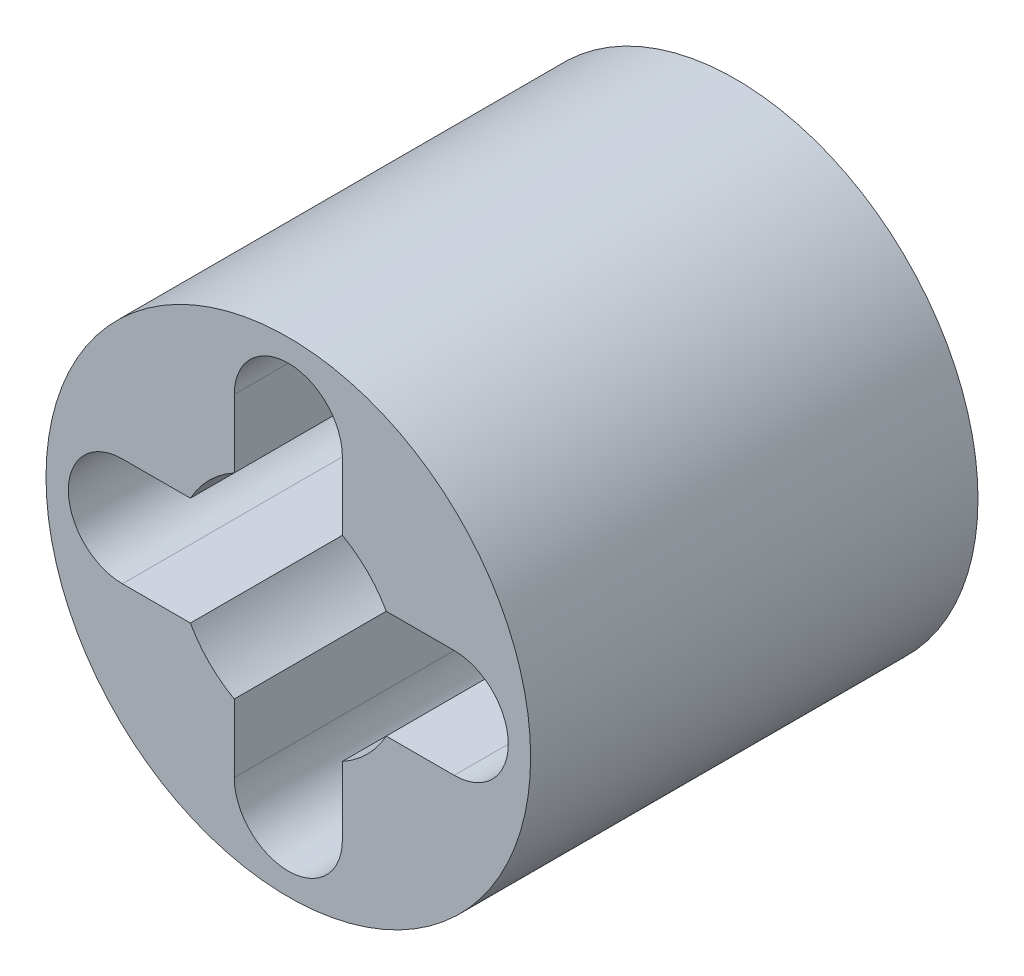
ISO-10303-21;
HEADER;
FILE_DESCRIPTION(('STEP AP214'),'2;1');
FILE_NAME('part.step','',(''),(''),'','','');
FILE_SCHEMA(('AUTOMOTIVE_DESIGN { 1 0 10303 214 1 1 1 1 }'));
ENDSEC;
DATA;
#1=APPLICATION_CONTEXT('core data for automotive mechanical design processes');
#2=APPLICATION_PROTOCOL_DEFINITION('international standard','automotive_design',2000,#1);
#3=PRODUCT_CONTEXT('',#1,'mechanical');
#4=PRODUCT('Part','Part','',(#3));
#5=PRODUCT_RELATED_PRODUCT_CATEGORY('part','',(#4));
#6=PRODUCT_DEFINITION_FORMATION('','',#4);
#7=PRODUCT_DEFINITION_CONTEXT('part definition',#1,'design');
#8=PRODUCT_DEFINITION('design','',#6,#7);
#9=PRODUCT_DEFINITION_SHAPE('','',#8);
#10=(LENGTH_UNIT() NAMED_UNIT(*) SI_UNIT(.MILLI.,.METRE.));
#11=(NAMED_UNIT(*) PLANE_ANGLE_UNIT() SI_UNIT($,.RADIAN.));
#12=(NAMED_UNIT(*) SI_UNIT($,.STERADIAN.) SOLID_ANGLE_UNIT());
#13=UNCERTAINTY_MEASURE_WITH_UNIT(LENGTH_MEASURE(1.E-05),#10,'distance_accuracy_value','');
#14=(GEOMETRIC_REPRESENTATION_CONTEXT(3) GLOBAL_UNCERTAINTY_ASSIGNED_CONTEXT((#13)) GLOBAL_UNIT_ASSIGNED_CONTEXT((#10,
#11,#12)) REPRESENTATION_CONTEXT('',''));
#15=CARTESIAN_POINT('',(0.,0.,0.));
#16=DIRECTION('',(0.,0.,1.));
#17=DIRECTION('',(1.,0.,0.));
#18=AXIS2_PLACEMENT_3D('',#15,#16,#17);
#19=CARTESIAN_POINT('',(0.,0.,6.));
#20=DIRECTION('',(0.,0.,1.));
#21=DIRECTION('',(1.,0.,0.));
#22=AXIS2_PLACEMENT_3D('',#19,#20,#21);
#23=PLANE('',#22);
#24=CARTESIAN_POINT('',(0.,0.,6.));
#25=DIRECTION('',(0.,0.,1.));
#26=DIRECTION('',(1.,0.,0.));
#27=AXIS2_PLACEMENT_3D('',#24,#25,#26);
#28=CIRCLE('',#27,3.25);
#29=CARTESIAN_POINT('',(3.25,0.,6.));
#30=VERTEX_POINT('',#29);
#31=EDGE_CURVE('E11',#30,#30,#28,.T.);
#32=ORIENTED_EDGE('',*,*,#31,.T.);
#33=EDGE_LOOP('',(#32));
#34=FACE_BOUND('',#33,.T.);
#35=DIRECTION('',(1.,0.,0.));
#36=VECTOR('',#35,1.);
#37=CARTESIAN_POINT('',(2.22500000000006,-0.724999999999986,6.));
#38=LINE('',#37,#36);
#39=CARTESIAN_POINT('',(1.31315459866689,-0.724999999999986,6.));
#40=VERTEX_POINT('',#39);
#41=CARTESIAN_POINT('',(2.22500000000006,-0.724999999999961,6.));
#42=VERTEX_POINT('',#41);
#43=EDGE_CURVE('E154',#40,#42,#38,.T.);
#44=ORIENTED_EDGE('',*,*,#43,.F.);
#45=CARTESIAN_POINT('',(0.,0.,6.));
#46=DIRECTION('',(0.,0.,1.));
#47=DIRECTION('',(1.,0.,0.));
#48=AXIS2_PLACEMENT_3D('',#45,#46,#47);
#49=CIRCLE('',#48,1.5);
#50=CARTESIAN_POINT('',(0.725000000000126,-1.31315459866682,6.));
#51=VERTEX_POINT('',#50);
#52=EDGE_CURVE('E146',#51,#40,#49,.T.);
#53=ORIENTED_EDGE('',*,*,#52,.F.);
#54=DIRECTION('',(0.,1.,0.));
#55=VECTOR('',#54,1.);
#56=CARTESIAN_POINT('',(0.725000000000126,-2.225,6.));
#57=LINE('',#56,#55);
#58=CARTESIAN_POINT('',(0.725000000000126,-2.225,6.));
#59=VERTEX_POINT('',#58);
#60=EDGE_CURVE('E194',#59,#51,#57,.T.);
#61=ORIENTED_EDGE('',*,*,#60,.F.);
#62=CARTESIAN_POINT('',(1.25931639139677E-13,-2.225,6.));
#63=DIRECTION('',(0.,0.,1.));
#64=DIRECTION('',(1.,0.,0.));
#65=AXIS2_PLACEMENT_3D('',#62,#63,#64);
#66=CIRCLE('',#65,0.725);
#67=CARTESIAN_POINT('',(-0.724999999999874,-2.225,6.));
#68=VERTEX_POINT('',#67);
#69=EDGE_CURVE('E192',#68,#59,#66,.T.);
#70=ORIENTED_EDGE('',*,*,#69,.F.);
#71=DIRECTION('',(0.,-1.,0.));
#72=VECTOR('',#71,1.);
#73=CARTESIAN_POINT('',(-0.724999999999874,-2.225,6.));
#74=LINE('',#73,#72);
#75=CARTESIAN_POINT('',(-0.724999999999874,-1.31315459866696,6.));
#76=VERTEX_POINT('',#75);
#77=EDGE_CURVE('E190',#76,#68,#74,.T.);
#78=ORIENTED_EDGE('',*,*,#77,.F.);
#79=CARTESIAN_POINT('',(0.,0.,6.));
#80=DIRECTION('',(0.,0.,1.));
#81=DIRECTION('',(1.,0.,0.));
#82=AXIS2_PLACEMENT_3D('',#79,#80,#81);
#83=CIRCLE('',#82,1.5);
#84=CARTESIAN_POINT('',(-1.31315459866689,-0.725,6.));
#85=VERTEX_POINT('',#84);
#86=EDGE_CURVE('E188',#85,#76,#83,.T.);
#87=ORIENTED_EDGE('',*,*,#86,.F.);
#88=DIRECTION('',(1.,0.,0.));
#89=VECTOR('',#88,1.);
#90=CARTESIAN_POINT('',(-2.22499999999994,-0.725000000000063,6.));
#91=LINE('',#90,#89);
#92=CARTESIAN_POINT('',(-2.22499999999994,-0.725000000000063,6.));
#93=VERTEX_POINT('',#92);
#94=EDGE_CURVE('E186',#93,#85,#91,.T.);
#95=ORIENTED_EDGE('',*,*,#94,.F.);
#96=CARTESIAN_POINT('',(-2.22499999999994,0.,6.));
#97=DIRECTION('',(0.,0.,1.));
#98=DIRECTION('',(1.,0.,0.));
#99=AXIS2_PLACEMENT_3D('',#96,#97,#98);
#100=CIRCLE('',#99,0.725);
#101=CARTESIAN_POINT('',(-2.22499999999994,0.724999999999937,6.));
#102=VERTEX_POINT('',#101);
#103=EDGE_CURVE('E184',#102,#93,#100,.T.);
#104=ORIENTED_EDGE('',*,*,#103,.F.);
#105=DIRECTION('',(-1.,0.,0.));
#106=VECTOR('',#105,1.);
#107=CARTESIAN_POINT('',(-2.22499999999994,0.724999999999937,6.));
#108=LINE('',#107,#106);
#109=CARTESIAN_POINT('',(-1.31315459866692,0.724999999999937,6.));
#110=VERTEX_POINT('',#109);
#111=EDGE_CURVE('E182',#110,#102,#108,.T.);
#112=ORIENTED_EDGE('',*,*,#111,.F.);
#113=CARTESIAN_POINT('',(0.,0.,6.));
#114=DIRECTION('',(0.,0.,1.));
#115=DIRECTION('',(1.,0.,0.));
#116=AXIS2_PLACEMENT_3D('',#113,#114,#115);
#117=CIRCLE('',#116,1.49999999999999);
#118=CARTESIAN_POINT('',(-0.725000000000003,1.31315459866688,6.));
#119=VERTEX_POINT('',#118);
#120=EDGE_CURVE('E180',#119,#110,#117,.T.);
#121=ORIENTED_EDGE('',*,*,#120,.F.);
#122=DIRECTION('',(0.,-1.,0.));
#123=VECTOR('',#122,1.);
#124=CARTESIAN_POINT('',(-0.725,2.225,6.));
#125=LINE('',#124,#123);
#126=CARTESIAN_POINT('',(-0.725,2.225,6.));
#127=VERTEX_POINT('',#126);
#128=EDGE_CURVE('E178',#127,#119,#125,.T.);
#129=ORIENTED_EDGE('',*,*,#128,.F.);
#130=CARTESIAN_POINT('',(0.,2.225,6.));
#131=DIRECTION('',(0.,0.,1.));
#132=DIRECTION('',(1.,0.,0.));
#133=AXIS2_PLACEMENT_3D('',#130,#131,#132);
#134=CIRCLE('',#133,0.725);
#135=CARTESIAN_POINT('',(0.725,2.225,6.));
#136=VERTEX_POINT('',#135);
#137=EDGE_CURVE('E176',#136,#127,#134,.T.);
#138=ORIENTED_EDGE('',*,*,#137,.F.);
#139=DIRECTION('',(0.,1.,0.));
#140=VECTOR('',#139,1.);
#141=CARTESIAN_POINT('',(0.725,2.225,6.));
#142=LINE('',#141,#140);
#143=CARTESIAN_POINT('',(0.725,1.31315459866689,6.));
#144=VERTEX_POINT('',#143);
#145=EDGE_CURVE('E174',#144,#136,#142,.T.);
#146=ORIENTED_EDGE('',*,*,#145,.F.);
#147=CARTESIAN_POINT('',(0.,0.,6.));
#148=DIRECTION('',(0.,0.,1.));
#149=DIRECTION('',(1.,0.,0.));
#150=AXIS2_PLACEMENT_3D('',#147,#148,#149);
#151=CIRCLE('',#150,1.5);
#152=CARTESIAN_POINT('',(1.31315459866688,0.725000000000001,6.));
#153=VERTEX_POINT('',#152);
#154=EDGE_CURVE('E172',#153,#144,#151,.T.);
#155=ORIENTED_EDGE('',*,*,#154,.F.);
#156=DIRECTION('',(-1.,0.,0.));
#157=VECTOR('',#156,1.);
#158=CARTESIAN_POINT('',(2.22500000000006,0.725000000000063,6.));
#159=LINE('',#158,#157);
#160=CARTESIAN_POINT('',(2.22500000000006,0.725000000000063,6.));
#161=VERTEX_POINT('',#160);
#162=EDGE_CURVE('E168',#161,#153,#159,.T.);
#163=ORIENTED_EDGE('',*,*,#162,.F.);
#164=CARTESIAN_POINT('',(2.22500000000006,0.,6.));
#165=DIRECTION('',(0.,0.,1.));
#166=DIRECTION('',(1.,0.,0.));
#167=AXIS2_PLACEMENT_3D('',#164,#165,#166);
#168=CIRCLE('',#167,0.725000000000025);
#169=EDGE_CURVE('E166',#42,#161,#168,.T.);
#170=ORIENTED_EDGE('',*,*,#169,.F.);
#171=EDGE_LOOP('',(#44,#53,#61,#70,#78,#87,#95,#104,#112,#121,#129,#138,#146,#155,#163,#170));
#172=FACE_BOUND('',#171,.T.);
#173=ADVANCED_FACE('F33',(#34,#172),#23,.T.);
#174=CARTESIAN_POINT('',(0.,0.,0.));
#175=DIRECTION('',(0.,0.,1.));
#176=DIRECTION('',(1.,0.,0.));
#177=AXIS2_PLACEMENT_3D('',#174,#175,#176);
#178=PLANE('',#177);
#179=CARTESIAN_POINT('',(0.,0.,0.));
#180=DIRECTION('',(0.,0.,1.));
#181=DIRECTION('',(1.,0.,0.));
#182=AXIS2_PLACEMENT_3D('',#179,#180,#181);
#183=CIRCLE('',#182,3.25);
#184=CARTESIAN_POINT('',(3.25,0.,0.));
#185=VERTEX_POINT('',#184);
#186=EDGE_CURVE('E37',#185,#185,#183,.T.);
#187=ORIENTED_EDGE('',*,*,#186,.F.);
#188=EDGE_LOOP('',(#187));
#189=FACE_BOUND('',#188,.T.);
#190=CARTESIAN_POINT('',(0.,0.,0.));
#191=DIRECTION('',(0.,0.,1.));
#192=DIRECTION('',(1.,0.,0.));
#193=AXIS2_PLACEMENT_3D('',#190,#191,#192);
#194=CIRCLE('',#193,1.5);
#195=CARTESIAN_POINT('',(0.725000000000126,-1.31315459866682,0.));
#196=VERTEX_POINT('',#195);
#197=CARTESIAN_POINT('',(1.31315459866689,-0.724999999999986,0.));
#198=VERTEX_POINT('',#197);
#199=EDGE_CURVE('E56',#196,#198,#194,.T.);
#200=ORIENTED_EDGE('',*,*,#199,.T.);
#201=DIRECTION('',(1.,0.,0.));
#202=VECTOR('',#201,1.);
#203=CARTESIAN_POINT('',(2.22500000000006,-0.724999999999986,0.));
#204=LINE('',#203,#202);
#205=CARTESIAN_POINT('',(2.22500000000006,-0.724999999999961,0.));
#206=VERTEX_POINT('',#205);
#207=EDGE_CURVE('E161',#198,#206,#204,.T.);
#208=ORIENTED_EDGE('',*,*,#207,.T.);
#209=CARTESIAN_POINT('',(2.22500000000006,0.,0.));
#210=DIRECTION('',(0.,0.,1.));
#211=DIRECTION('',(1.,0.,0.));
#212=AXIS2_PLACEMENT_3D('',#209,#210,#211);
#213=CIRCLE('',#212,0.725000000000025);
#214=CARTESIAN_POINT('',(2.22500000000006,0.725000000000063,0.));
#215=VERTEX_POINT('',#214);
#216=EDGE_CURVE('E198',#206,#215,#213,.T.);
#217=ORIENTED_EDGE('',*,*,#216,.T.);
#218=DIRECTION('',(-1.,0.,0.));
#219=VECTOR('',#218,1.);
#220=CARTESIAN_POINT('',(2.22500000000006,0.725000000000063,0.));
#221=LINE('',#220,#219);
#222=CARTESIAN_POINT('',(1.31315459866688,0.725000000000001,0.));
#223=VERTEX_POINT('',#222);
#224=EDGE_CURVE('E201',#215,#223,#221,.T.);
#225=ORIENTED_EDGE('',*,*,#224,.T.);
#226=CARTESIAN_POINT('',(0.,0.,0.));
#227=DIRECTION('',(0.,0.,1.));
#228=DIRECTION('',(1.,0.,0.));
#229=AXIS2_PLACEMENT_3D('',#226,#227,#228);
#230=CIRCLE('',#229,1.5);
#231=CARTESIAN_POINT('',(0.725,1.31315459866689,0.));
#232=VERTEX_POINT('',#231);
#233=EDGE_CURVE('E204',#223,#232,#230,.T.);
#234=ORIENTED_EDGE('',*,*,#233,.T.);
#235=DIRECTION('',(0.,1.,0.));
#236=VECTOR('',#235,1.);
#237=CARTESIAN_POINT('',(0.725,2.225,0.));
#238=LINE('',#237,#236);
#239=CARTESIAN_POINT('',(0.725,2.225,0.));
#240=VERTEX_POINT('',#239);
#241=EDGE_CURVE('E207',#232,#240,#238,.T.);
#242=ORIENTED_EDGE('',*,*,#241,.T.);
#243=CARTESIAN_POINT('',(0.,2.225,0.));
#244=DIRECTION('',(0.,0.,1.));
#245=DIRECTION('',(1.,0.,0.));
#246=AXIS2_PLACEMENT_3D('',#243,#244,#245);
#247=CIRCLE('',#246,0.725);
#248=CARTESIAN_POINT('',(-0.725,2.225,0.));
#249=VERTEX_POINT('',#248);
#250=EDGE_CURVE('E210',#240,#249,#247,.T.);
#251=ORIENTED_EDGE('',*,*,#250,.T.);
#252=DIRECTION('',(0.,-1.,0.));
#253=VECTOR('',#252,1.);
#254=CARTESIAN_POINT('',(-0.725,2.225,0.));
#255=LINE('',#254,#253);
#256=CARTESIAN_POINT('',(-0.725000000000003,1.31315459866688,0.));
#257=VERTEX_POINT('',#256);
#258=EDGE_CURVE('E213',#249,#257,#255,.T.);
#259=ORIENTED_EDGE('',*,*,#258,.T.);
#260=CARTESIAN_POINT('',(0.,0.,0.));
#261=DIRECTION('',(0.,0.,1.));
#262=DIRECTION('',(1.,0.,0.));
#263=AXIS2_PLACEMENT_3D('',#260,#261,#262);
#264=CIRCLE('',#263,1.49999999999999);
#265=CARTESIAN_POINT('',(-1.31315459866692,0.724999999999937,0.));
#266=VERTEX_POINT('',#265);
#267=EDGE_CURVE('E216',#257,#266,#264,.T.);
#268=ORIENTED_EDGE('',*,*,#267,.T.);
#269=DIRECTION('',(-1.,0.,0.));
#270=VECTOR('',#269,1.);
#271=CARTESIAN_POINT('',(-2.22499999999994,0.724999999999937,0.));
#272=LINE('',#271,#270);
#273=CARTESIAN_POINT('',(-2.22499999999994,0.724999999999937,0.));
#274=VERTEX_POINT('',#273);
#275=EDGE_CURVE('E219',#266,#274,#272,.T.);
#276=ORIENTED_EDGE('',*,*,#275,.T.);
#277=CARTESIAN_POINT('',(-2.22499999999994,0.,0.));
#278=DIRECTION('',(0.,0.,1.));
#279=DIRECTION('',(1.,0.,0.));
#280=AXIS2_PLACEMENT_3D('',#277,#278,#279);
#281=CIRCLE('',#280,0.725);
#282=CARTESIAN_POINT('',(-2.22499999999994,-0.725000000000063,0.));
#283=VERTEX_POINT('',#282);
#284=EDGE_CURVE('E222',#274,#283,#281,.T.);
#285=ORIENTED_EDGE('',*,*,#284,.T.);
#286=DIRECTION('',(1.,0.,0.));
#287=VECTOR('',#286,1.);
#288=CARTESIAN_POINT('',(-2.22499999999994,-0.725000000000063,0.));
#289=LINE('',#288,#287);
#290=CARTESIAN_POINT('',(-1.31315459866689,-0.725,0.));
#291=VERTEX_POINT('',#290);
#292=EDGE_CURVE('E225',#283,#291,#289,.T.);
#293=ORIENTED_EDGE('',*,*,#292,.T.);
#294=CARTESIAN_POINT('',(0.,0.,0.));
#295=DIRECTION('',(0.,0.,1.));
#296=DIRECTION('',(1.,0.,0.));
#297=AXIS2_PLACEMENT_3D('',#294,#295,#296);
#298=CIRCLE('',#297,1.5);
#299=CARTESIAN_POINT('',(-0.724999999999874,-1.31315459866696,0.));
#300=VERTEX_POINT('',#299);
#301=EDGE_CURVE('E228',#291,#300,#298,.T.);
#302=ORIENTED_EDGE('',*,*,#301,.T.);
#303=DIRECTION('',(0.,-1.,0.));
#304=VECTOR('',#303,1.);
#305=CARTESIAN_POINT('',(-0.724999999999874,-2.225,0.));
#306=LINE('',#305,#304);
#307=CARTESIAN_POINT('',(-0.724999999999874,-2.225,0.));
#308=VERTEX_POINT('',#307);
#309=EDGE_CURVE('E231',#300,#308,#306,.T.);
#310=ORIENTED_EDGE('',*,*,#309,.T.);
#311=CARTESIAN_POINT('',(1.25931639139677E-13,-2.225,0.));
#312=DIRECTION('',(0.,0.,1.));
#313=DIRECTION('',(1.,0.,0.));
#314=AXIS2_PLACEMENT_3D('',#311,#312,#313);
#315=CIRCLE('',#314,0.725);
#316=CARTESIAN_POINT('',(0.725000000000126,-2.225,0.));
#317=VERTEX_POINT('',#316);
#318=EDGE_CURVE('E234',#308,#317,#315,.T.);
#319=ORIENTED_EDGE('',*,*,#318,.T.);
#320=DIRECTION('',(0.,1.,0.));
#321=VECTOR('',#320,1.);
#322=CARTESIAN_POINT('',(0.725000000000126,-2.225,0.));
#323=LINE('',#322,#321);
#324=EDGE_CURVE('E155',#317,#196,#323,.T.);
#325=ORIENTED_EDGE('',*,*,#324,.T.);
#326=EDGE_LOOP('',(#200,#208,#217,#225,#234,#242,#251,#259,#268,#276,#285,#293,#302,#310,#319,#325));
#327=FACE_BOUND('',#326,.T.);
#328=ADVANCED_FACE('F271',(#189,#327),#178,.F.);
#329=CARTESIAN_POINT('',(0.,0.,6.));
#330=DIRECTION('',(0.,0.,-1.));
#331=DIRECTION('',(-1.,0.,0.));
#332=AXIS2_PLACEMENT_3D('',#329,#330,#331);
#333=CYLINDRICAL_SURFACE('',#332,3.25);
#334=ORIENTED_EDGE('',*,*,#31,.F.);
#335=EDGE_LOOP('',(#334));
#336=FACE_BOUND('',#335,.T.);
#337=ORIENTED_EDGE('',*,*,#186,.T.);
#338=EDGE_LOOP('',(#337));
#339=FACE_BOUND('',#338,.T.);
#340=ADVANCED_FACE('F35',(#336,#339),#333,.T.);
#341=CARTESIAN_POINT('',(0.,0.,6.));
#342=DIRECTION('',(0.,0.,-1.));
#343=DIRECTION('',(-1.,0.,0.));
#344=AXIS2_PLACEMENT_3D('',#341,#342,#343);
#345=CYLINDRICAL_SURFACE('',#344,1.5);
#346=ORIENTED_EDGE('',*,*,#199,.F.);
#347=DIRECTION('',(0.,0.,-1.));
#348=VECTOR('',#347,1.);
#349=CARTESIAN_POINT('',(0.725000000000126,-1.31315459866682,6.));
#350=LINE('',#349,#348);
#351=EDGE_CURVE('E150',#51,#196,#350,.T.);
#352=ORIENTED_EDGE('',*,*,#351,.F.);
#353=ORIENTED_EDGE('',*,*,#52,.T.);
#354=DIRECTION('',(0.,0.,-1.));
#355=VECTOR('',#354,1.);
#356=CARTESIAN_POINT('',(1.31315459866689,-0.724999999999986,6.));
#357=LINE('',#356,#355);
#358=EDGE_CURVE('E149',#40,#198,#357,.T.);
#359=ORIENTED_EDGE('',*,*,#358,.T.);
#360=EDGE_LOOP('',(#346,#352,#353,#359));
#361=FACE_BOUND('',#360,.T.);
#362=ADVANCED_FACE('F148',(#361),#345,.F.);
#363=CARTESIAN_POINT('',(2.22500000000006,-0.724999999999986,6.));
#364=DIRECTION('',(0.,1.,0.));
#365=DIRECTION('',(0.,0.,1.));
#366=AXIS2_PLACEMENT_3D('',#363,#364,#365);
#367=PLANE('',#366);
#368=ORIENTED_EDGE('',*,*,#207,.F.);
#369=ORIENTED_EDGE('',*,*,#358,.F.);
#370=ORIENTED_EDGE('',*,*,#43,.T.);
#371=DIRECTION('',(0.,0.,-1.));
#372=VECTOR('',#371,1.);
#373=CARTESIAN_POINT('',(2.22500000000006,-0.724999999999961,6.));
#374=LINE('',#373,#372);
#375=EDGE_CURVE('E162',#42,#206,#374,.T.);
#376=ORIENTED_EDGE('',*,*,#375,.T.);
#377=EDGE_LOOP('',(#368,#369,#370,#376));
#378=FACE_BOUND('',#377,.T.);
#379=ADVANCED_FACE('F158',(#378),#367,.T.);
#380=CARTESIAN_POINT('',(2.22500000000006,0.,6.));
#381=DIRECTION('',(0.,0.,-1.));
#382=DIRECTION('',(-1.,0.,0.));
#383=AXIS2_PLACEMENT_3D('',#380,#381,#382);
#384=CYLINDRICAL_SURFACE('',#383,0.725000000000025);
#385=ORIENTED_EDGE('',*,*,#216,.F.);
#386=ORIENTED_EDGE('',*,*,#375,.F.);
#387=ORIENTED_EDGE('',*,*,#169,.T.);
#388=DIRECTION('',(0.,0.,-1.));
#389=VECTOR('',#388,1.);
#390=CARTESIAN_POINT('',(2.22500000000006,0.725000000000063,6.));
#391=LINE('',#390,#389);
#392=EDGE_CURVE('E263',#161,#215,#391,.T.);
#393=ORIENTED_EDGE('',*,*,#392,.T.);
#394=EDGE_LOOP('',(#385,#386,#387,#393));
#395=FACE_BOUND('',#394,.T.);
#396=ADVANCED_FACE('F267',(#395),#384,.F.);
#397=CARTESIAN_POINT('',(2.22500000000006,0.725000000000063,6.));
#398=DIRECTION('',(0.,-1.,0.));
#399=DIRECTION('',(1.,0.,0.));
#400=AXIS2_PLACEMENT_3D('',#397,#398,#399);
#401=PLANE('',#400);
#402=ORIENTED_EDGE('',*,*,#224,.F.);
#403=ORIENTED_EDGE('',*,*,#392,.F.);
#404=ORIENTED_EDGE('',*,*,#162,.T.);
#405=DIRECTION('',(0.,0.,-1.));
#406=VECTOR('',#405,1.);
#407=CARTESIAN_POINT('',(1.31315459866688,0.725000000000001,6.));
#408=LINE('',#407,#406);
#409=EDGE_CURVE('E261',#153,#223,#408,.T.);
#410=ORIENTED_EDGE('',*,*,#409,.T.);
#411=EDGE_LOOP('',(#402,#403,#404,#410));
#412=FACE_BOUND('',#411,.T.);
#413=ADVANCED_FACE('F329',(#412),#401,.T.);
#414=CARTESIAN_POINT('',(0.,0.,6.));
#415=DIRECTION('',(0.,0.,-1.));
#416=DIRECTION('',(-1.,0.,0.));
#417=AXIS2_PLACEMENT_3D('',#414,#415,#416);
#418=CYLINDRICAL_SURFACE('',#417,1.5);
#419=ORIENTED_EDGE('',*,*,#233,.F.);
#420=ORIENTED_EDGE('',*,*,#409,.F.);
#421=ORIENTED_EDGE('',*,*,#154,.T.);
#422=DIRECTION('',(0.,0.,-1.));
#423=VECTOR('',#422,1.);
#424=CARTESIAN_POINT('',(0.725,1.31315459866689,6.));
#425=LINE('',#424,#423);
#426=EDGE_CURVE('E259',#144,#232,#425,.T.);
#427=ORIENTED_EDGE('',*,*,#426,.T.);
#428=EDGE_LOOP('',(#419,#420,#421,#427));
#429=FACE_BOUND('',#428,.T.);
#430=ADVANCED_FACE('F326',(#429),#418,.F.);
#431=CARTESIAN_POINT('',(0.725,2.225,6.));
#432=DIRECTION('',(-1.,0.,0.));
#433=DIRECTION('',(0.,0.,1.));
#434=AXIS2_PLACEMENT_3D('',#431,#432,#433);
#435=PLANE('',#434);
#436=ORIENTED_EDGE('',*,*,#241,.F.);
#437=ORIENTED_EDGE('',*,*,#426,.F.);
#438=ORIENTED_EDGE('',*,*,#145,.T.);
#439=DIRECTION('',(0.,0.,-1.));
#440=VECTOR('',#439,1.);
#441=CARTESIAN_POINT('',(0.725,2.225,6.));
#442=LINE('',#441,#440);
#443=EDGE_CURVE('E257',#136,#240,#442,.T.);
#444=ORIENTED_EDGE('',*,*,#443,.T.);
#445=EDGE_LOOP('',(#436,#437,#438,#444));
#446=FACE_BOUND('',#445,.T.);
#447=ADVANCED_FACE('F323',(#446),#435,.T.);
#448=CARTESIAN_POINT('',(0.,2.225,6.));
#449=DIRECTION('',(0.,0.,-1.));
#450=DIRECTION('',(-1.,0.,0.));
#451=AXIS2_PLACEMENT_3D('',#448,#449,#450);
#452=CYLINDRICAL_SURFACE('',#451,0.725);
#453=ORIENTED_EDGE('',*,*,#250,.F.);
#454=ORIENTED_EDGE('',*,*,#443,.F.);
#455=ORIENTED_EDGE('',*,*,#137,.T.);
#456=DIRECTION('',(0.,0.,-1.));
#457=VECTOR('',#456,1.);
#458=CARTESIAN_POINT('',(-0.725,2.225,6.));
#459=LINE('',#458,#457);
#460=EDGE_CURVE('E255',#127,#249,#459,.T.);
#461=ORIENTED_EDGE('',*,*,#460,.T.);
#462=EDGE_LOOP('',(#453,#454,#455,#461));
#463=FACE_BOUND('',#462,.T.);
#464=ADVANCED_FACE('F316',(#463),#452,.F.);
#465=CARTESIAN_POINT('',(-0.725,2.225,6.));
#466=DIRECTION('',(1.,0.,0.));
#467=DIRECTION('',(0.,0.,-1.));
#468=AXIS2_PLACEMENT_3D('',#465,#466,#467);
#469=PLANE('',#468);
#470=ORIENTED_EDGE('',*,*,#258,.F.);
#471=ORIENTED_EDGE('',*,*,#460,.F.);
#472=ORIENTED_EDGE('',*,*,#128,.T.);
#473=DIRECTION('',(0.,0.,-1.));
#474=VECTOR('',#473,1.);
#475=CARTESIAN_POINT('',(-0.725000000000003,1.31315459866688,6.));
#476=LINE('',#475,#474);
#477=EDGE_CURVE('E253',#119,#257,#476,.T.);
#478=ORIENTED_EDGE('',*,*,#477,.T.);
#479=EDGE_LOOP('',(#470,#471,#472,#478));
#480=FACE_BOUND('',#479,.T.);
#481=ADVANCED_FACE('F312',(#480),#469,.T.);
#482=CARTESIAN_POINT('',(0.,0.,6.));
#483=DIRECTION('',(0.,0.,-1.));
#484=DIRECTION('',(-1.,0.,0.));
#485=AXIS2_PLACEMENT_3D('',#482,#483,#484);
#486=CYLINDRICAL_SURFACE('',#485,1.49999999999999);
#487=ORIENTED_EDGE('',*,*,#267,.F.);
#488=ORIENTED_EDGE('',*,*,#477,.F.);
#489=ORIENTED_EDGE('',*,*,#120,.T.);
#490=DIRECTION('',(0.,0.,-1.));
#491=VECTOR('',#490,1.);
#492=CARTESIAN_POINT('',(-1.31315459866692,0.724999999999937,6.));
#493=LINE('',#492,#491);
#494=EDGE_CURVE('E251',#110,#266,#493,.T.);
#495=ORIENTED_EDGE('',*,*,#494,.T.);
#496=EDGE_LOOP('',(#487,#488,#489,#495));
#497=FACE_BOUND('',#496,.T.);
#498=ADVANCED_FACE('F309',(#497),#486,.F.);
#499=CARTESIAN_POINT('',(-2.22499999999994,0.724999999999937,6.));
#500=DIRECTION('',(0.,-1.,0.));
#501=DIRECTION('',(0.,0.,-1.));
#502=AXIS2_PLACEMENT_3D('',#499,#500,#501);
#503=PLANE('',#502);
#504=ORIENTED_EDGE('',*,*,#275,.F.);
#505=ORIENTED_EDGE('',*,*,#494,.F.);
#506=ORIENTED_EDGE('',*,*,#111,.T.);
#507=DIRECTION('',(0.,0.,-1.));
#508=VECTOR('',#507,1.);
#509=CARTESIAN_POINT('',(-2.22499999999994,0.724999999999937,6.));
#510=LINE('',#509,#508);
#511=EDGE_CURVE('E249',#102,#274,#510,.T.);
#512=ORIENTED_EDGE('',*,*,#511,.T.);
#513=EDGE_LOOP('',(#504,#505,#506,#512));
#514=FACE_BOUND('',#513,.T.);
#515=ADVANCED_FACE('F301',(#514),#503,.T.);
#516=CARTESIAN_POINT('',(-2.22499999999994,0.,6.));
#517=DIRECTION('',(0.,0.,-1.));
#518=DIRECTION('',(-1.,0.,0.));
#519=AXIS2_PLACEMENT_3D('',#516,#517,#518);
#520=CYLINDRICAL_SURFACE('',#519,0.725);
#521=ORIENTED_EDGE('',*,*,#284,.F.);
#522=ORIENTED_EDGE('',*,*,#511,.F.);
#523=ORIENTED_EDGE('',*,*,#103,.T.);
#524=DIRECTION('',(0.,0.,-1.));
#525=VECTOR('',#524,1.);
#526=CARTESIAN_POINT('',(-2.22499999999994,-0.725000000000063,6.));
#527=LINE('',#526,#525);
#528=EDGE_CURVE('E247',#93,#283,#527,.T.);
#529=ORIENTED_EDGE('',*,*,#528,.T.);
#530=EDGE_LOOP('',(#521,#522,#523,#529));
#531=FACE_BOUND('',#530,.T.);
#532=ADVANCED_FACE('F297',(#531),#520,.F.);
#533=CARTESIAN_POINT('',(-2.22499999999994,-0.725000000000063,6.));
#534=DIRECTION('',(0.,1.,0.));
#535=DIRECTION('',(-1.,0.,0.));
#536=AXIS2_PLACEMENT_3D('',#533,#534,#535);
#537=PLANE('',#536);
#538=ORIENTED_EDGE('',*,*,#292,.F.);
#539=ORIENTED_EDGE('',*,*,#528,.F.);
#540=ORIENTED_EDGE('',*,*,#94,.T.);
#541=DIRECTION('',(0.,0.,-1.));
#542=VECTOR('',#541,1.);
#543=CARTESIAN_POINT('',(-1.31315459866689,-0.725,6.));
#544=LINE('',#543,#542);
#545=EDGE_CURVE('E245',#85,#291,#544,.T.);
#546=ORIENTED_EDGE('',*,*,#545,.T.);
#547=EDGE_LOOP('',(#538,#539,#540,#546));
#548=FACE_BOUND('',#547,.T.);
#549=ADVANCED_FACE('F294',(#548),#537,.T.);
#550=CARTESIAN_POINT('',(0.,0.,6.));
#551=DIRECTION('',(0.,0.,-1.));
#552=DIRECTION('',(-1.,0.,0.));
#553=AXIS2_PLACEMENT_3D('',#550,#551,#552);
#554=CYLINDRICAL_SURFACE('',#553,1.5);
#555=ORIENTED_EDGE('',*,*,#301,.F.);
#556=ORIENTED_EDGE('',*,*,#545,.F.);
#557=ORIENTED_EDGE('',*,*,#86,.T.);
#558=DIRECTION('',(0.,0.,-1.));
#559=VECTOR('',#558,1.);
#560=CARTESIAN_POINT('',(-0.724999999999874,-1.31315459866696,6.));
#561=LINE('',#560,#559);
#562=EDGE_CURVE('E243',#76,#300,#561,.T.);
#563=ORIENTED_EDGE('',*,*,#562,.T.);
#564=EDGE_LOOP('',(#555,#556,#557,#563));
#565=FACE_BOUND('',#564,.T.);
#566=ADVANCED_FACE('F286',(#565),#554,.F.);
#567=CARTESIAN_POINT('',(-0.724999999999874,-2.225,6.));
#568=DIRECTION('',(1.,0.,0.));
#569=DIRECTION('',(0.,1.,0.));
#570=AXIS2_PLACEMENT_3D('',#567,#568,#569);
#571=PLANE('',#570);
#572=ORIENTED_EDGE('',*,*,#309,.F.);
#573=ORIENTED_EDGE('',*,*,#562,.F.);
#574=ORIENTED_EDGE('',*,*,#77,.T.);
#575=DIRECTION('',(0.,0.,-1.));
#576=VECTOR('',#575,1.);
#577=CARTESIAN_POINT('',(-0.724999999999874,-2.225,6.));
#578=LINE('',#577,#576);
#579=EDGE_CURVE('E241',#68,#308,#578,.T.);
#580=ORIENTED_EDGE('',*,*,#579,.T.);
#581=EDGE_LOOP('',(#572,#573,#574,#580));
#582=FACE_BOUND('',#581,.T.);
#583=ADVANCED_FACE('F282',(#582),#571,.T.);
#584=CARTESIAN_POINT('',(1.25931639139677E-13,-2.225,6.));
#585=DIRECTION('',(0.,0.,-1.));
#586=DIRECTION('',(-1.,0.,0.));
#587=AXIS2_PLACEMENT_3D('',#584,#585,#586);
#588=CYLINDRICAL_SURFACE('',#587,0.725);
#589=ORIENTED_EDGE('',*,*,#318,.F.);
#590=ORIENTED_EDGE('',*,*,#579,.F.);
#591=ORIENTED_EDGE('',*,*,#69,.T.);
#592=DIRECTION('',(0.,0.,-1.));
#593=VECTOR('',#592,1.);
#594=CARTESIAN_POINT('',(0.725000000000126,-2.225,6.));
#595=LINE('',#594,#593);
#596=EDGE_CURVE('E48',#59,#317,#595,.T.);
#597=ORIENTED_EDGE('',*,*,#596,.T.);
#598=EDGE_LOOP('',(#589,#590,#591,#597));
#599=FACE_BOUND('',#598,.T.);
#600=ADVANCED_FACE('F279',(#599),#588,.F.);
#601=CARTESIAN_POINT('',(0.725000000000126,-2.225,6.));
#602=DIRECTION('',(-1.,0.,0.));
#603=DIRECTION('',(0.,-1.,0.));
#604=AXIS2_PLACEMENT_3D('',#601,#602,#603);
#605=PLANE('',#604);
#606=ORIENTED_EDGE('',*,*,#324,.F.);
#607=ORIENTED_EDGE('',*,*,#596,.F.);
#608=ORIENTED_EDGE('',*,*,#60,.T.);
#609=ORIENTED_EDGE('',*,*,#351,.T.);
#610=EDGE_LOOP('',(#606,#607,#608,#609));
#611=FACE_BOUND('',#610,.T.);
#612=ADVANCED_FACE('F273',(#611),#605,.T.);
#613=CLOSED_SHELL('',(#173,#328,#340,#362,#379,#396,#413,#430,#447,#464,#481,#498,#515,#532,
#549,#566,#583,#600,#612));
#614=MANIFOLD_SOLID_BREP('B2',#613);
#615=ADVANCED_BREP_SHAPE_REPRESENTATION('',(#18,#614),#14);
#616=SHAPE_DEFINITION_REPRESENTATION(#9,#615);
ENDSEC;
END-ISO-10303-21;
